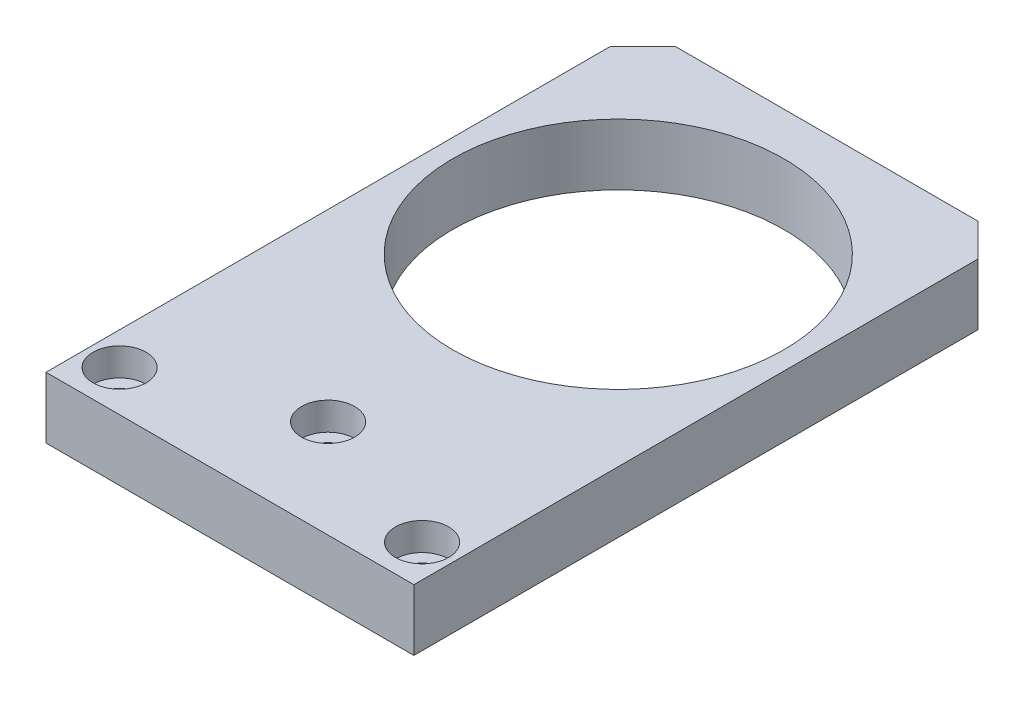
ISO-10303-21;
HEADER;
FILE_DESCRIPTION(('STEP AP214'),'2;1');
FILE_NAME('part.step','',(''),(''),'','','');
FILE_SCHEMA(('AUTOMOTIVE_DESIGN { 1 0 10303 214 1 1 1 1 }'));
ENDSEC;
DATA;
#1=APPLICATION_CONTEXT('core data for automotive mechanical design processes');
#2=APPLICATION_PROTOCOL_DEFINITION('international standard','automotive_design',2000,#1);
#3=PRODUCT_CONTEXT('',#1,'mechanical');
#4=PRODUCT('Part','Part','',(#3));
#5=PRODUCT_RELATED_PRODUCT_CATEGORY('part','',(#4));
#6=PRODUCT_DEFINITION_FORMATION('','',#4);
#7=PRODUCT_DEFINITION_CONTEXT('part definition',#1,'design');
#8=PRODUCT_DEFINITION('design','',#6,#7);
#9=PRODUCT_DEFINITION_SHAPE('','',#8);
#10=(LENGTH_UNIT() NAMED_UNIT(*) SI_UNIT(.MILLI.,.METRE.));
#11=(NAMED_UNIT(*) PLANE_ANGLE_UNIT() SI_UNIT($,.RADIAN.));
#12=(NAMED_UNIT(*) SI_UNIT($,.STERADIAN.) SOLID_ANGLE_UNIT());
#13=UNCERTAINTY_MEASURE_WITH_UNIT(LENGTH_MEASURE(1.E-05),#10,'distance_accuracy_value','');
#14=(GEOMETRIC_REPRESENTATION_CONTEXT(3) GLOBAL_UNCERTAINTY_ASSIGNED_CONTEXT((#13)) GLOBAL_UNIT_ASSIGNED_CONTEXT((#10,
#11,#12)) REPRESENTATION_CONTEXT('',''));
#15=CARTESIAN_POINT('',(0.,0.,0.));
#16=DIRECTION('',(0.,0.,1.));
#17=DIRECTION('',(1.,0.,0.));
#18=AXIS2_PLACEMENT_3D('',#15,#16,#17);
#19=CARTESIAN_POINT('',(0.,7.5,0.));
#20=DIRECTION('',(0.,-1.,0.));
#21=DIRECTION('',(0.,0.,-1.));
#22=AXIS2_PLACEMENT_3D('',#19,#20,#21);
#23=PLANE('',#22);
#24=CARTESIAN_POINT('',(-18.5,7.5,-5.));
#25=DIRECTION('',(0.,1.,0.));
#26=DIRECTION('',(0.,0.,1.));
#27=AXIS2_PLACEMENT_3D('',#24,#25,#26);
#28=CIRCLE('',#27,3.25);
#29=CARTESIAN_POINT('',(-18.5,7.5,-1.75));
#30=VERTEX_POINT('',#29);
#31=EDGE_CURVE('E190',#30,#30,#28,.T.);
#32=ORIENTED_EDGE('',*,*,#31,.F.);
#33=EDGE_LOOP('',(#32));
#34=FACE_BOUND('',#33,.T.);
#35=CARTESIAN_POINT('',(0.,7.5,-12.));
#36=DIRECTION('',(0.,1.,0.));
#37=DIRECTION('',(0.,0.,1.));
#38=AXIS2_PLACEMENT_3D('',#35,#36,#37);
#39=CIRCLE('',#38,3.25);
#40=CARTESIAN_POINT('',(0.,7.5,-8.75));
#41=VERTEX_POINT('',#40);
#42=EDGE_CURVE('E178',#41,#41,#39,.T.);
#43=ORIENTED_EDGE('',*,*,#42,.F.);
#44=EDGE_LOOP('',(#43));
#45=FACE_BOUND('',#44,.T.);
#46=CARTESIAN_POINT('',(18.5,7.5,-5.));
#47=DIRECTION('',(0.,1.,0.));
#48=DIRECTION('',(0.,0.,1.));
#49=AXIS2_PLACEMENT_3D('',#46,#47,#48);
#50=CIRCLE('',#49,3.25);
#51=CARTESIAN_POINT('',(18.5,7.5,-1.75));
#52=VERTEX_POINT('',#51);
#53=EDGE_CURVE('E166',#52,#52,#50,.T.);
#54=ORIENTED_EDGE('',*,*,#53,.F.);
#55=EDGE_LOOP('',(#54));
#56=FACE_BOUND('',#55,.T.);
#57=DIRECTION('',(-1.,0.,0.));
#58=VECTOR('',#57,1.);
#59=CARTESIAN_POINT('',(-22.5,7.5,-73.));
#60=LINE('',#59,#58);
#61=CARTESIAN_POINT('',(18.5,7.5,-73.));
#62=VERTEX_POINT('',#61);
#63=CARTESIAN_POINT('',(-18.5,7.5,-73.));
#64=VERTEX_POINT('',#63);
#65=EDGE_CURVE('E121',#62,#64,#60,.T.);
#66=ORIENTED_EDGE('',*,*,#65,.T.);
#67=DIRECTION('',(0.707106781186549,0.,-0.707106781186546));
#68=VECTOR('',#67,1.);
#69=CARTESIAN_POINT('',(-22.5,7.5,-69.));
#70=LINE('',#69,#68);
#71=CARTESIAN_POINT('',(-22.5,7.5,-69.));
#72=VERTEX_POINT('',#71);
#73=EDGE_CURVE('E47',#64,#72,#70,.F.);
#74=ORIENTED_EDGE('',*,*,#73,.T.);
#75=DIRECTION('',(0.,0.,1.));
#76=VECTOR('',#75,1.);
#77=CARTESIAN_POINT('',(-22.5,7.5,0.));
#78=LINE('',#77,#76);
#79=CARTESIAN_POINT('',(-22.5,7.5,0.));
#80=VERTEX_POINT('',#79);
#81=EDGE_CURVE('E93',#72,#80,#78,.T.);
#82=ORIENTED_EDGE('',*,*,#81,.T.);
#83=DIRECTION('',(1.,0.,0.));
#84=VECTOR('',#83,1.);
#85=CARTESIAN_POINT('',(-22.5,7.5,0.));
#86=LINE('',#85,#84);
#87=CARTESIAN_POINT('',(22.5,7.5,0.));
#88=VERTEX_POINT('',#87);
#89=EDGE_CURVE('E96',#80,#88,#86,.T.);
#90=ORIENTED_EDGE('',*,*,#89,.T.);
#91=DIRECTION('',(0.,0.,-1.));
#92=VECTOR('',#91,1.);
#93=CARTESIAN_POINT('',(22.5,7.5,0.));
#94=LINE('',#93,#92);
#95=CARTESIAN_POINT('',(22.5,7.5,-69.));
#96=VERTEX_POINT('',#95);
#97=EDGE_CURVE('E111',#88,#96,#94,.T.);
#98=ORIENTED_EDGE('',*,*,#97,.T.);
#99=DIRECTION('',(0.707106781186548,0.,0.707106781186548));
#100=VECTOR('',#99,1.);
#101=CARTESIAN_POINT('',(18.5,7.5,-73.));
#102=LINE('',#101,#100);
#103=EDGE_CURVE('E132',#96,#62,#102,.F.);
#104=ORIENTED_EDGE('',*,*,#103,.T.);
#105=EDGE_LOOP('',(#66,#74,#82,#90,#98,#104));
#106=FACE_BOUND('',#105,.T.);
#107=CARTESIAN_POINT('',(0.,7.5,-47.5));
#108=DIRECTION('',(0.,1.,0.));
#109=DIRECTION('',(0.,0.,1.));
#110=AXIS2_PLACEMENT_3D('',#107,#108,#109);
#111=CIRCLE('',#110,20.25);
#112=CARTESIAN_POINT('',(0.,7.5,-27.25));
#113=VERTEX_POINT('',#112);
#114=EDGE_CURVE('E149',#113,#113,#111,.T.);
#115=ORIENTED_EDGE('',*,*,#114,.F.);
#116=EDGE_LOOP('',(#115));
#117=FACE_BOUND('',#116,.T.);
#118=ADVANCED_FACE('F39',(#34,#45,#56,#106,#117),#23,.F.);
#119=CARTESIAN_POINT('',(0.,0.,0.));
#120=DIRECTION('',(0.,-1.,0.));
#121=DIRECTION('',(0.,0.,-1.));
#122=AXIS2_PLACEMENT_3D('',#119,#120,#121);
#123=PLANE('',#122);
#124=CARTESIAN_POINT('',(-18.5,0.,-5.));
#125=DIRECTION('',(0.,-1.,0.));
#126=DIRECTION('',(0.,0.,-1.));
#127=AXIS2_PLACEMENT_3D('',#124,#125,#126);
#128=CIRCLE('',#127,1.7);
#129=CARTESIAN_POINT('',(-18.5,0.,-6.7));
#130=VERTEX_POINT('',#129);
#131=EDGE_CURVE('E181',#130,#130,#128,.T.);
#132=ORIENTED_EDGE('',*,*,#131,.F.);
#133=EDGE_LOOP('',(#132));
#134=FACE_BOUND('',#133,.T.);
#135=CARTESIAN_POINT('',(0.,0.,-12.));
#136=DIRECTION('',(0.,-1.,0.));
#137=DIRECTION('',(0.,0.,-1.));
#138=AXIS2_PLACEMENT_3D('',#135,#136,#137);
#139=CIRCLE('',#138,1.7);
#140=CARTESIAN_POINT('',(0.,0.,-13.7));
#141=VERTEX_POINT('',#140);
#142=EDGE_CURVE('E169',#141,#141,#139,.T.);
#143=ORIENTED_EDGE('',*,*,#142,.F.);
#144=EDGE_LOOP('',(#143));
#145=FACE_BOUND('',#144,.T.);
#146=CARTESIAN_POINT('',(18.5,0.,-5.));
#147=DIRECTION('',(0.,-1.,0.));
#148=DIRECTION('',(0.,0.,-1.));
#149=AXIS2_PLACEMENT_3D('',#146,#147,#148);
#150=CIRCLE('',#149,1.7);
#151=CARTESIAN_POINT('',(18.5,0.,-6.7));
#152=VERTEX_POINT('',#151);
#153=EDGE_CURVE('E155',#152,#152,#150,.T.);
#154=ORIENTED_EDGE('',*,*,#153,.F.);
#155=EDGE_LOOP('',(#154));
#156=FACE_BOUND('',#155,.T.);
#157=DIRECTION('',(0.,0.,1.));
#158=VECTOR('',#157,1.);
#159=CARTESIAN_POINT('',(-22.5,0.,0.));
#160=LINE('',#159,#158);
#161=CARTESIAN_POINT('',(-22.5,0.,-69.));
#162=VERTEX_POINT('',#161);
#163=CARTESIAN_POINT('',(-22.5,0.,0.));
#164=VERTEX_POINT('',#163);
#165=EDGE_CURVE('E115',#162,#164,#160,.T.);
#166=ORIENTED_EDGE('',*,*,#165,.F.);
#167=DIRECTION('',(-0.707106781186549,0.,0.707106781186546));
#168=VECTOR('',#167,1.);
#169=CARTESIAN_POINT('',(-45.75,0.,-45.7500000000001));
#170=LINE('',#169,#168);
#171=CARTESIAN_POINT('',(-18.5,0.,-73.));
#172=VERTEX_POINT('',#171);
#173=EDGE_CURVE('E126',#162,#172,#170,.F.);
#174=ORIENTED_EDGE('',*,*,#173,.T.);
#175=DIRECTION('',(-1.,0.,0.));
#176=VECTOR('',#175,1.);
#177=CARTESIAN_POINT('',(-22.5,0.,-73.));
#178=LINE('',#177,#176);
#179=CARTESIAN_POINT('',(18.5,0.,-73.));
#180=VERTEX_POINT('',#179);
#181=EDGE_CURVE('E103',#180,#172,#178,.T.);
#182=ORIENTED_EDGE('',*,*,#181,.F.);
#183=DIRECTION('',(-0.707106781186548,0.,-0.707106781186548));
#184=VECTOR('',#183,1.);
#185=CARTESIAN_POINT('',(45.75,0.,-45.75));
#186=LINE('',#185,#184);
#187=CARTESIAN_POINT('',(22.5,0.,-69.));
#188=VERTEX_POINT('',#187);
#189=EDGE_CURVE('E119',#180,#188,#186,.F.);
#190=ORIENTED_EDGE('',*,*,#189,.T.);
#191=DIRECTION('',(0.,0.,-1.));
#192=VECTOR('',#191,1.);
#193=CARTESIAN_POINT('',(22.5,0.,0.));
#194=LINE('',#193,#192);
#195=CARTESIAN_POINT('',(22.5,0.,0.));
#196=VERTEX_POINT('',#195);
#197=EDGE_CURVE('E143',#196,#188,#194,.T.);
#198=ORIENTED_EDGE('',*,*,#197,.F.);
#199=DIRECTION('',(1.,0.,0.));
#200=VECTOR('',#199,1.);
#201=CARTESIAN_POINT('',(-22.5,0.,0.));
#202=LINE('',#201,#200);
#203=EDGE_CURVE('E145',#164,#196,#202,.T.);
#204=ORIENTED_EDGE('',*,*,#203,.F.);
#205=EDGE_LOOP('',(#166,#174,#182,#190,#198,#204));
#206=FACE_BOUND('',#205,.T.);
#207=CARTESIAN_POINT('',(0.,0.,-47.5));
#208=DIRECTION('',(0.,1.,0.));
#209=DIRECTION('',(0.,0.,1.));
#210=AXIS2_PLACEMENT_3D('',#207,#208,#209);
#211=CIRCLE('',#210,20.25);
#212=CARTESIAN_POINT('',(0.,0.,-27.25));
#213=VERTEX_POINT('',#212);
#214=EDGE_CURVE('E152',#213,#213,#211,.T.);
#215=ORIENTED_EDGE('',*,*,#214,.T.);
#216=EDGE_LOOP('',(#215));
#217=FACE_BOUND('',#216,.T.);
#218=ADVANCED_FACE('F141',(#134,#145,#156,#206,#217),#123,.T.);
#219=CARTESIAN_POINT('',(-22.5,7.5,0.));
#220=DIRECTION('',(1.,0.,0.));
#221=DIRECTION('',(0.,0.,-1.));
#222=AXIS2_PLACEMENT_3D('',#219,#220,#221);
#223=PLANE('',#222);
#224=ORIENTED_EDGE('',*,*,#81,.F.);
#225=DIRECTION('',(0.,-1.,0.));
#226=VECTOR('',#225,1.);
#227=CARTESIAN_POINT('',(-22.5,7.5,-69.));
#228=LINE('',#227,#226);
#229=EDGE_CURVE('E117',#72,#162,#228,.T.);
#230=ORIENTED_EDGE('',*,*,#229,.T.);
#231=ORIENTED_EDGE('',*,*,#165,.T.);
#232=DIRECTION('',(0.,-1.,0.));
#233=VECTOR('',#232,1.);
#234=CARTESIAN_POINT('',(-22.5,7.5,0.));
#235=LINE('',#234,#233);
#236=EDGE_CURVE('E108',#80,#164,#235,.T.);
#237=ORIENTED_EDGE('',*,*,#236,.F.);
#238=EDGE_LOOP('',(#224,#230,#231,#237));
#239=FACE_BOUND('',#238,.T.);
#240=ADVANCED_FACE('F113',(#239),#223,.F.);
#241=CARTESIAN_POINT('',(-22.5,7.5,0.));
#242=DIRECTION('',(0.,0.,-1.));
#243=DIRECTION('',(-1.,0.,0.));
#244=AXIS2_PLACEMENT_3D('',#241,#242,#243);
#245=PLANE('',#244);
#246=ORIENTED_EDGE('',*,*,#203,.T.);
#247=DIRECTION('',(0.,-1.,0.));
#248=VECTOR('',#247,1.);
#249=CARTESIAN_POINT('',(22.5,7.5,0.));
#250=LINE('',#249,#248);
#251=EDGE_CURVE('E110',#88,#196,#250,.T.);
#252=ORIENTED_EDGE('',*,*,#251,.F.);
#253=ORIENTED_EDGE('',*,*,#89,.F.);
#254=ORIENTED_EDGE('',*,*,#236,.T.);
#255=EDGE_LOOP('',(#246,#252,#253,#254));
#256=FACE_BOUND('',#255,.T.);
#257=ADVANCED_FACE('F107',(#256),#245,.F.);
#258=CARTESIAN_POINT('',(22.5,7.5,0.));
#259=DIRECTION('',(-1.,0.,0.));
#260=DIRECTION('',(0.,0.,1.));
#261=AXIS2_PLACEMENT_3D('',#258,#259,#260);
#262=PLANE('',#261);
#263=ORIENTED_EDGE('',*,*,#197,.T.);
#264=DIRECTION('',(0.,1.,0.));
#265=VECTOR('',#264,1.);
#266=CARTESIAN_POINT('',(22.5,7.5,-69.));
#267=LINE('',#266,#265);
#268=EDGE_CURVE('E11',#188,#96,#267,.T.);
#269=ORIENTED_EDGE('',*,*,#268,.T.);
#270=ORIENTED_EDGE('',*,*,#97,.F.);
#271=ORIENTED_EDGE('',*,*,#251,.T.);
#272=EDGE_LOOP('',(#263,#269,#270,#271));
#273=FACE_BOUND('',#272,.T.);
#274=ADVANCED_FACE('F144',(#273),#262,.F.);
#275=CARTESIAN_POINT('',(-22.5,7.5,-73.));
#276=DIRECTION('',(0.,0.,1.));
#277=DIRECTION('',(1.,0.,0.));
#278=AXIS2_PLACEMENT_3D('',#275,#276,#277);
#279=PLANE('',#278);
#280=ORIENTED_EDGE('',*,*,#181,.T.);
#281=DIRECTION('',(0.,1.,0.));
#282=VECTOR('',#281,1.);
#283=CARTESIAN_POINT('',(-18.5,7.5,-73.));
#284=LINE('',#283,#282);
#285=EDGE_CURVE('E60',#172,#64,#284,.T.);
#286=ORIENTED_EDGE('',*,*,#285,.T.);
#287=ORIENTED_EDGE('',*,*,#65,.F.);
#288=DIRECTION('',(0.,-1.,0.));
#289=VECTOR('',#288,1.);
#290=CARTESIAN_POINT('',(18.5,7.5,-73.));
#291=LINE('',#290,#289);
#292=EDGE_CURVE('E128',#62,#180,#291,.T.);
#293=ORIENTED_EDGE('',*,*,#292,.T.);
#294=EDGE_LOOP('',(#280,#286,#287,#293));
#295=FACE_BOUND('',#294,.T.);
#296=ADVANCED_FACE('F136',(#295),#279,.F.);
#297=CARTESIAN_POINT('',(0.,7.5,-47.5));
#298=DIRECTION('',(0.,-1.,0.));
#299=DIRECTION('',(0.,0.,-1.));
#300=AXIS2_PLACEMENT_3D('',#297,#298,#299);
#301=CYLINDRICAL_SURFACE('',#300,20.25);
#302=ORIENTED_EDGE('',*,*,#114,.T.);
#303=EDGE_LOOP('',(#302));
#304=FACE_BOUND('',#303,.T.);
#305=ORIENTED_EDGE('',*,*,#214,.F.);
#306=EDGE_LOOP('',(#305));
#307=FACE_BOUND('',#306,.T.);
#308=ADVANCED_FACE('F225',(#304,#307),#301,.F.);
#309=CARTESIAN_POINT('',(-22.5,7.5,-69.));
#310=DIRECTION('',(0.707106781186546,0.,0.707106781186549));
#311=DIRECTION('',(0.,-1.,0.));
#312=AXIS2_PLACEMENT_3D('',#309,#310,#311);
#313=PLANE('',#312);
#314=ORIENTED_EDGE('',*,*,#73,.F.);
#315=ORIENTED_EDGE('',*,*,#285,.F.);
#316=ORIENTED_EDGE('',*,*,#173,.F.);
#317=ORIENTED_EDGE('',*,*,#229,.F.);
#318=EDGE_LOOP('',(#314,#315,#316,#317));
#319=FACE_BOUND('',#318,.T.);
#320=ADVANCED_FACE('F227',(#319),#313,.F.);
#321=CARTESIAN_POINT('',(18.5,7.5,-73.));
#322=DIRECTION('',(-0.707106781186548,0.,0.707106781186548));
#323=DIRECTION('',(0.,-1.,0.));
#324=AXIS2_PLACEMENT_3D('',#321,#322,#323);
#325=PLANE('',#324);
#326=ORIENTED_EDGE('',*,*,#103,.F.);
#327=ORIENTED_EDGE('',*,*,#268,.F.);
#328=ORIENTED_EDGE('',*,*,#189,.F.);
#329=ORIENTED_EDGE('',*,*,#292,.F.);
#330=EDGE_LOOP('',(#326,#327,#328,#329));
#331=FACE_BOUND('',#330,.T.);
#332=ADVANCED_FACE('F41',(#331),#325,.F.);
#333=CARTESIAN_POINT('',(18.5,7.5,-5.));
#334=DIRECTION('',(0.,1.,0.));
#335=DIRECTION('',(0.,0.,1.));
#336=AXIS2_PLACEMENT_3D('',#333,#334,#335);
#337=CYLINDRICAL_SURFACE('',#336,1.7);
#338=CARTESIAN_POINT('',(18.5,4.1,-5.));
#339=DIRECTION('',(0.,1.,0.));
#340=DIRECTION('',(0.,0.,1.));
#341=AXIS2_PLACEMENT_3D('',#338,#339,#340);
#342=CIRCLE('',#341,1.7);
#343=CARTESIAN_POINT('',(18.5,4.1,-3.3));
#344=VERTEX_POINT('',#343);
#345=EDGE_CURVE('E160',#344,#344,#342,.T.);
#346=ORIENTED_EDGE('',*,*,#345,.T.);
#347=EDGE_LOOP('',(#346));
#348=FACE_BOUND('',#347,.T.);
#349=ORIENTED_EDGE('',*,*,#153,.T.);
#350=EDGE_LOOP('',(#349));
#351=FACE_BOUND('',#350,.T.);
#352=ADVANCED_FACE('F216',(#348,#351),#337,.F.);
#353=CARTESIAN_POINT('',(20.2,4.1,-5.));
#354=DIRECTION('',(0.,-1.,0.));
#355=DIRECTION('',(0.,0.,-1.));
#356=AXIS2_PLACEMENT_3D('',#353,#354,#355);
#357=PLANE('',#356);
#358=ORIENTED_EDGE('',*,*,#345,.F.);
#359=EDGE_LOOP('',(#358));
#360=FACE_BOUND('',#359,.T.);
#361=CARTESIAN_POINT('',(18.5,4.1,-5.));
#362=DIRECTION('',(0.,1.,0.));
#363=DIRECTION('',(0.,0.,1.));
#364=AXIS2_PLACEMENT_3D('',#361,#362,#363);
#365=CIRCLE('',#364,3.25);
#366=CARTESIAN_POINT('',(18.5,4.1,-1.75));
#367=VERTEX_POINT('',#366);
#368=EDGE_CURVE('E163',#367,#367,#365,.T.);
#369=ORIENTED_EDGE('',*,*,#368,.T.);
#370=EDGE_LOOP('',(#369));
#371=FACE_BOUND('',#370,.T.);
#372=ADVANCED_FACE('F206',(#360,#371),#357,.F.);
#373=CARTESIAN_POINT('',(18.5,7.5,-5.));
#374=DIRECTION('',(0.,1.,0.));
#375=DIRECTION('',(0.,0.,1.));
#376=AXIS2_PLACEMENT_3D('',#373,#374,#375);
#377=CYLINDRICAL_SURFACE('',#376,3.25);
#378=ORIENTED_EDGE('',*,*,#368,.F.);
#379=EDGE_LOOP('',(#378));
#380=FACE_BOUND('',#379,.T.);
#381=ORIENTED_EDGE('',*,*,#53,.T.);
#382=EDGE_LOOP('',(#381));
#383=FACE_BOUND('',#382,.T.);
#384=ADVANCED_FACE('F203',(#380,#383),#377,.F.);
#385=CARTESIAN_POINT('',(0.,7.5,-12.));
#386=DIRECTION('',(0.,1.,0.));
#387=DIRECTION('',(0.,0.,1.));
#388=AXIS2_PLACEMENT_3D('',#385,#386,#387);
#389=CYLINDRICAL_SURFACE('',#388,1.7);
#390=CARTESIAN_POINT('',(0.,4.1,-12.));
#391=DIRECTION('',(0.,1.,0.));
#392=DIRECTION('',(0.,0.,1.));
#393=AXIS2_PLACEMENT_3D('',#390,#391,#392);
#394=CIRCLE('',#393,1.7);
#395=CARTESIAN_POINT('',(0.,4.1,-10.3));
#396=VERTEX_POINT('',#395);
#397=EDGE_CURVE('E172',#396,#396,#394,.T.);
#398=ORIENTED_EDGE('',*,*,#397,.T.);
#399=EDGE_LOOP('',(#398));
#400=FACE_BOUND('',#399,.T.);
#401=ORIENTED_EDGE('',*,*,#142,.T.);
#402=EDGE_LOOP('',(#401));
#403=FACE_BOUND('',#402,.T.);
#404=ADVANCED_FACE('F205',(#400,#403),#389,.F.);
#405=CARTESIAN_POINT('',(1.7,4.1,-12.));
#406=DIRECTION('',(0.,-1.,0.));
#407=DIRECTION('',(0.,0.,-1.));
#408=AXIS2_PLACEMENT_3D('',#405,#406,#407);
#409=PLANE('',#408);
#410=ORIENTED_EDGE('',*,*,#397,.F.);
#411=EDGE_LOOP('',(#410));
#412=FACE_BOUND('',#411,.T.);
#413=CARTESIAN_POINT('',(0.,4.1,-12.));
#414=DIRECTION('',(0.,1.,0.));
#415=DIRECTION('',(0.,0.,1.));
#416=AXIS2_PLACEMENT_3D('',#413,#414,#415);
#417=CIRCLE('',#416,3.25);
#418=CARTESIAN_POINT('',(0.,4.1,-8.75));
#419=VERTEX_POINT('',#418);
#420=EDGE_CURVE('E175',#419,#419,#417,.T.);
#421=ORIENTED_EDGE('',*,*,#420,.T.);
#422=EDGE_LOOP('',(#421));
#423=FACE_BOUND('',#422,.T.);
#424=ADVANCED_FACE('F213',(#412,#423),#409,.F.);
#425=CARTESIAN_POINT('',(0.,7.5,-12.));
#426=DIRECTION('',(0.,1.,0.));
#427=DIRECTION('',(0.,0.,1.));
#428=AXIS2_PLACEMENT_3D('',#425,#426,#427);
#429=CYLINDRICAL_SURFACE('',#428,3.25);
#430=ORIENTED_EDGE('',*,*,#420,.F.);
#431=EDGE_LOOP('',(#430));
#432=FACE_BOUND('',#431,.T.);
#433=ORIENTED_EDGE('',*,*,#42,.T.);
#434=EDGE_LOOP('',(#433));
#435=FACE_BOUND('',#434,.T.);
#436=ADVANCED_FACE('F276',(#432,#435),#429,.F.);
#437=CARTESIAN_POINT('',(-18.5,7.5,-5.));
#438=DIRECTION('',(0.,1.,0.));
#439=DIRECTION('',(0.,0.,1.));
#440=AXIS2_PLACEMENT_3D('',#437,#438,#439);
#441=CYLINDRICAL_SURFACE('',#440,1.7);
#442=CARTESIAN_POINT('',(-18.5,4.1,-5.));
#443=DIRECTION('',(0.,1.,0.));
#444=DIRECTION('',(0.,0.,1.));
#445=AXIS2_PLACEMENT_3D('',#442,#443,#444);
#446=CIRCLE('',#445,1.7);
#447=CARTESIAN_POINT('',(-18.5,4.1,-3.3));
#448=VERTEX_POINT('',#447);
#449=EDGE_CURVE('E184',#448,#448,#446,.T.);
#450=ORIENTED_EDGE('',*,*,#449,.T.);
#451=EDGE_LOOP('',(#450));
#452=FACE_BOUND('',#451,.T.);
#453=ORIENTED_EDGE('',*,*,#131,.T.);
#454=EDGE_LOOP('',(#453));
#455=FACE_BOUND('',#454,.T.);
#456=ADVANCED_FACE('F285',(#452,#455),#441,.F.);
#457=CARTESIAN_POINT('',(-16.8,4.1,-5.));
#458=DIRECTION('',(0.,-1.,0.));
#459=DIRECTION('',(0.,0.,-1.));
#460=AXIS2_PLACEMENT_3D('',#457,#458,#459);
#461=PLANE('',#460);
#462=ORIENTED_EDGE('',*,*,#449,.F.);
#463=EDGE_LOOP('',(#462));
#464=FACE_BOUND('',#463,.T.);
#465=CARTESIAN_POINT('',(-18.5,4.1,-5.));
#466=DIRECTION('',(0.,1.,0.));
#467=DIRECTION('',(0.,0.,1.));
#468=AXIS2_PLACEMENT_3D('',#465,#466,#467);
#469=CIRCLE('',#468,3.25);
#470=CARTESIAN_POINT('',(-18.5,4.1,-1.75));
#471=VERTEX_POINT('',#470);
#472=EDGE_CURVE('E187',#471,#471,#469,.T.);
#473=ORIENTED_EDGE('',*,*,#472,.T.);
#474=EDGE_LOOP('',(#473));
#475=FACE_BOUND('',#474,.T.);
#476=ADVANCED_FACE('F295',(#464,#475),#461,.F.);
#477=CARTESIAN_POINT('',(-18.5,7.5,-5.));
#478=DIRECTION('',(0.,1.,0.));
#479=DIRECTION('',(0.,0.,1.));
#480=AXIS2_PLACEMENT_3D('',#477,#478,#479);
#481=CYLINDRICAL_SURFACE('',#480,3.25);
#482=ORIENTED_EDGE('',*,*,#472,.F.);
#483=EDGE_LOOP('',(#482));
#484=FACE_BOUND('',#483,.T.);
#485=ORIENTED_EDGE('',*,*,#31,.T.);
#486=EDGE_LOOP('',(#485));
#487=FACE_BOUND('',#486,.T.);
#488=ADVANCED_FACE('F194',(#484,#487),#481,.F.);
#489=CLOSED_SHELL('',(#118,#218,#240,#257,#274,#296,#308,#320,#332,#352,#372,#384,#404,#424,
#436,#456,#476,#488));
#490=MANIFOLD_SOLID_BREP('B2',#489);
#491=ADVANCED_BREP_SHAPE_REPRESENTATION('',(#18,#490),#14);
#492=SHAPE_DEFINITION_REPRESENTATION(#9,#491);
ENDSEC;
END-ISO-10303-21;
